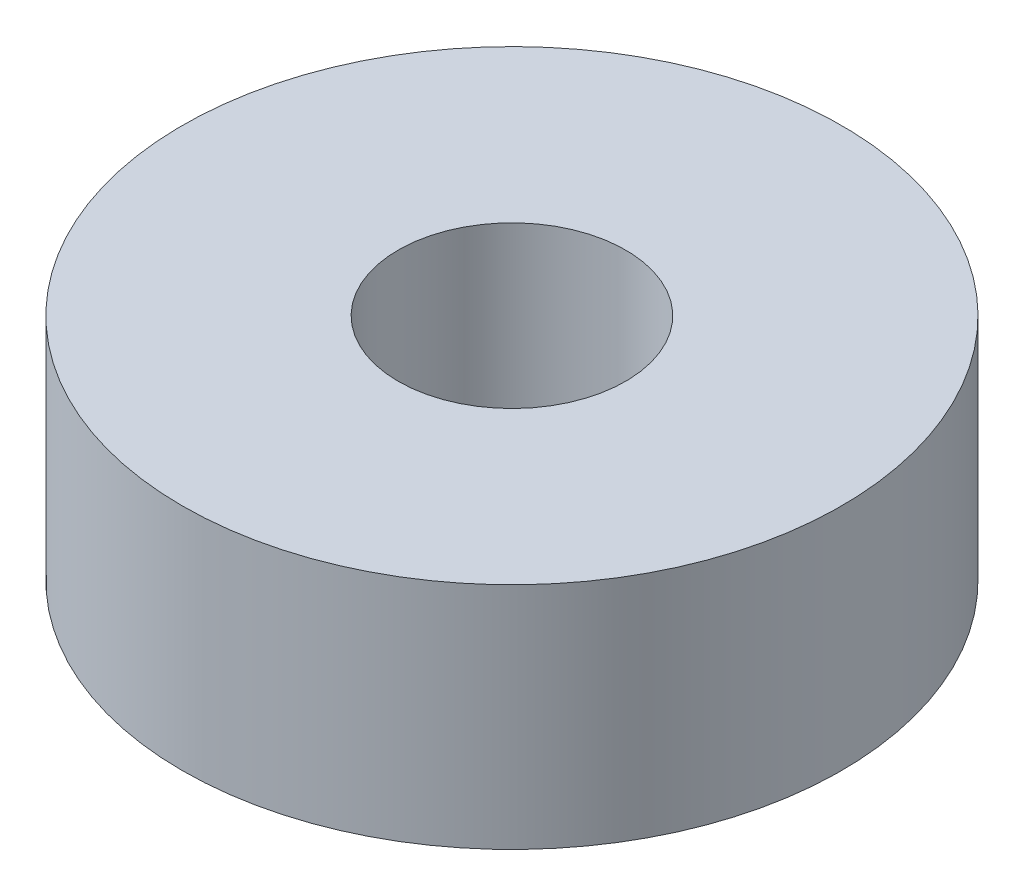
ISO-10303-21;
HEADER;
FILE_DESCRIPTION(('STEP AP214'),'2;1');
FILE_NAME('part.step','',(''),(''),'','','');
FILE_SCHEMA(('AUTOMOTIVE_DESIGN { 1 0 10303 214 1 1 1 1 }'));
ENDSEC;
DATA;
#1=APPLICATION_CONTEXT('core data for automotive mechanical design processes');
#2=APPLICATION_PROTOCOL_DEFINITION('international standard','automotive_design',2000,#1);
#3=PRODUCT_CONTEXT('',#1,'mechanical');
#4=PRODUCT('Part','Part','',(#3));
#5=PRODUCT_RELATED_PRODUCT_CATEGORY('part','',(#4));
#6=PRODUCT_DEFINITION_FORMATION('','',#4);
#7=PRODUCT_DEFINITION_CONTEXT('part definition',#1,'design');
#8=PRODUCT_DEFINITION('design','',#6,#7);
#9=PRODUCT_DEFINITION_SHAPE('','',#8);
#10=(LENGTH_UNIT() NAMED_UNIT(*) SI_UNIT(.MILLI.,.METRE.));
#11=(NAMED_UNIT(*) PLANE_ANGLE_UNIT() SI_UNIT($,.RADIAN.));
#12=(NAMED_UNIT(*) SI_UNIT($,.STERADIAN.) SOLID_ANGLE_UNIT());
#13=UNCERTAINTY_MEASURE_WITH_UNIT(LENGTH_MEASURE(1.E-05),#10,'distance_accuracy_value','');
#14=(GEOMETRIC_REPRESENTATION_CONTEXT(3) GLOBAL_UNCERTAINTY_ASSIGNED_CONTEXT((#13)) GLOBAL_UNIT_ASSIGNED_CONTEXT((#10,
#11,#12)) REPRESENTATION_CONTEXT('',''));
#15=CARTESIAN_POINT('',(0.,0.,0.));
#16=DIRECTION('',(0.,0.,1.));
#17=DIRECTION('',(1.,0.,0.));
#18=AXIS2_PLACEMENT_3D('',#15,#16,#17);
#19=CARTESIAN_POINT('',(0.,8.,0.));
#20=DIRECTION('',(0.,1.,0.));
#21=DIRECTION('',(0.,0.,1.));
#22=AXIS2_PLACEMENT_3D('',#19,#20,#21);
#23=PLANE('',#22);
#24=CARTESIAN_POINT('',(0.,8.,0.));
#25=DIRECTION('',(0.,1.,0.));
#26=DIRECTION('',(0.,0.,1.));
#27=AXIS2_PLACEMENT_3D('',#24,#25,#26);
#28=CIRCLE('',#27,11.5);
#29=CARTESIAN_POINT('',(0.,8.,11.5));
#30=VERTEX_POINT('',#29);
#31=EDGE_CURVE('E10',#30,#30,#28,.T.);
#32=ORIENTED_EDGE('',*,*,#31,.T.);
#33=EDGE_LOOP('',(#32));
#34=FACE_BOUND('',#33,.T.);
#35=CARTESIAN_POINT('',(0.,8.,0.));
#36=DIRECTION('',(0.,1.,0.));
#37=DIRECTION('',(0.,0.,1.));
#38=AXIS2_PLACEMENT_3D('',#35,#36,#37);
#39=CIRCLE('',#38,3.96875);
#40=CARTESIAN_POINT('',(0.,8.,3.96875));
#41=VERTEX_POINT('',#40);
#42=EDGE_CURVE('E50',#41,#41,#39,.T.);
#43=ORIENTED_EDGE('',*,*,#42,.F.);
#44=EDGE_LOOP('',(#43));
#45=FACE_BOUND('',#44,.T.);
#46=ADVANCED_FACE('F37',(#34,#45),#23,.T.);
#47=CARTESIAN_POINT('',(0.,0.,0.));
#48=DIRECTION('',(0.,1.,0.));
#49=DIRECTION('',(0.,0.,1.));
#50=AXIS2_PLACEMENT_3D('',#47,#48,#49);
#51=PLANE('',#50);
#52=CARTESIAN_POINT('',(0.,0.,0.));
#53=DIRECTION('',(0.,1.,0.));
#54=DIRECTION('',(0.,0.,1.));
#55=AXIS2_PLACEMENT_3D('',#52,#53,#54);
#56=CIRCLE('',#55,11.5);
#57=CARTESIAN_POINT('',(0.,0.,11.5));
#58=VERTEX_POINT('',#57);
#59=EDGE_CURVE('E41',#58,#58,#56,.T.);
#60=ORIENTED_EDGE('',*,*,#59,.F.);
#61=EDGE_LOOP('',(#60));
#62=FACE_BOUND('',#61,.T.);
#63=CARTESIAN_POINT('',(0.,0.,0.));
#64=DIRECTION('',(0.,1.,0.));
#65=DIRECTION('',(0.,0.,1.));
#66=AXIS2_PLACEMENT_3D('',#63,#64,#65);
#67=CIRCLE('',#66,3.96875);
#68=CARTESIAN_POINT('',(0.,0.,3.96875));
#69=VERTEX_POINT('',#68);
#70=EDGE_CURVE('E52',#69,#69,#67,.T.);
#71=ORIENTED_EDGE('',*,*,#70,.T.);
#72=EDGE_LOOP('',(#71));
#73=FACE_BOUND('',#72,.T.);
#74=ADVANCED_FACE('F64',(#62,#73),#51,.F.);
#75=CARTESIAN_POINT('',(0.,8.,0.));
#76=DIRECTION('',(0.,-1.,0.));
#77=DIRECTION('',(0.,0.,-1.));
#78=AXIS2_PLACEMENT_3D('',#75,#76,#77);
#79=CYLINDRICAL_SURFACE('',#78,11.5);
#80=ORIENTED_EDGE('',*,*,#31,.F.);
#81=EDGE_LOOP('',(#80));
#82=FACE_BOUND('',#81,.T.);
#83=ORIENTED_EDGE('',*,*,#59,.T.);
#84=EDGE_LOOP('',(#83));
#85=FACE_BOUND('',#84,.T.);
#86=ADVANCED_FACE('F39',(#82,#85),#79,.T.);
#87=CARTESIAN_POINT('',(0.,8.,0.));
#88=DIRECTION('',(0.,-1.,0.));
#89=DIRECTION('',(0.,0.,-1.));
#90=AXIS2_PLACEMENT_3D('',#87,#88,#89);
#91=CYLINDRICAL_SURFACE('',#90,3.96875);
#92=ORIENTED_EDGE('',*,*,#42,.T.);
#93=EDGE_LOOP('',(#92));
#94=FACE_BOUND('',#93,.T.);
#95=ORIENTED_EDGE('',*,*,#70,.F.);
#96=EDGE_LOOP('',(#95));
#97=FACE_BOUND('',#96,.T.);
#98=ADVANCED_FACE('F60',(#94,#97),#91,.F.);
#99=CLOSED_SHELL('',(#46,#74,#86,#98));
#100=MANIFOLD_SOLID_BREP('B2',#99);
#101=ADVANCED_BREP_SHAPE_REPRESENTATION('',(#18,#100),#14);
#102=SHAPE_DEFINITION_REPRESENTATION(#9,#101);
ENDSEC;
END-ISO-10303-21;
